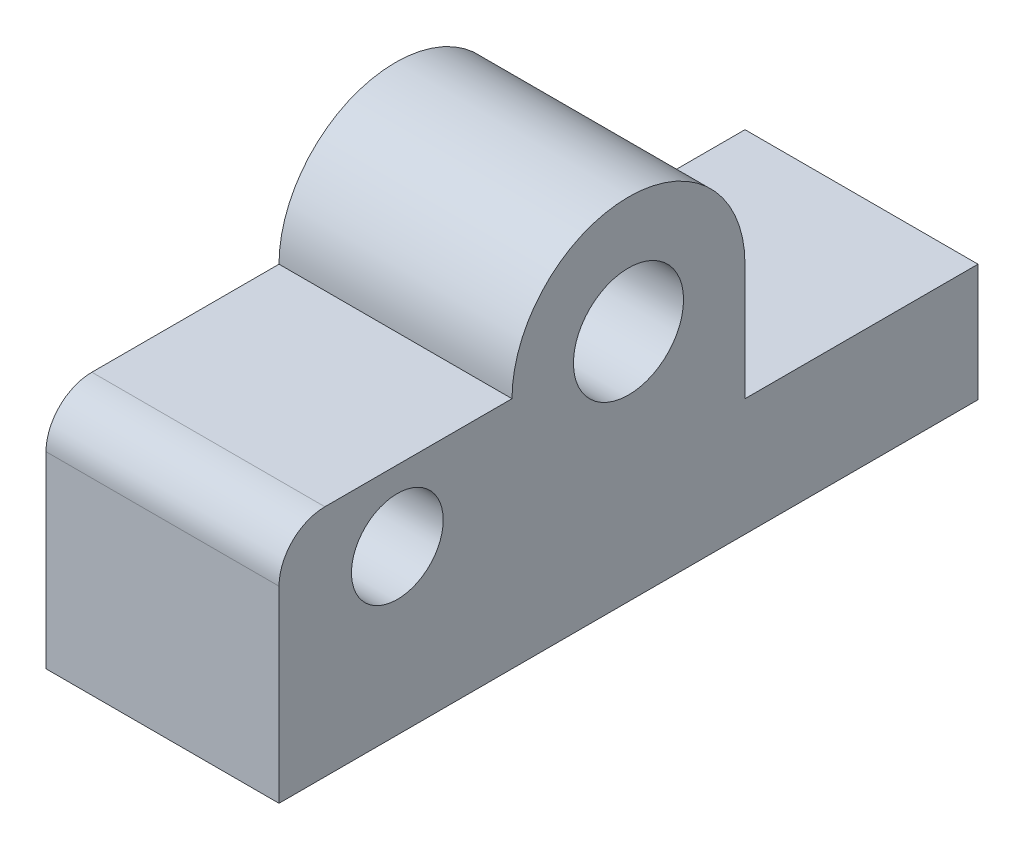
ISO-10303-21;
HEADER;
FILE_DESCRIPTION(('STEP AP214'),'2;1');
FILE_NAME('part.step','',(''),(''),'','','');
FILE_SCHEMA(('AUTOMOTIVE_DESIGN { 1 0 10303 214 1 1 1 1 }'));
ENDSEC;
DATA;
#1=APPLICATION_CONTEXT('core data for automotive mechanical design processes');
#2=APPLICATION_PROTOCOL_DEFINITION('international standard','automotive_design',2000,#1);
#3=PRODUCT_CONTEXT('',#1,'mechanical');
#4=PRODUCT('Part','Part','',(#3));
#5=PRODUCT_RELATED_PRODUCT_CATEGORY('part','',(#4));
#6=PRODUCT_DEFINITION_FORMATION('','',#4);
#7=PRODUCT_DEFINITION_CONTEXT('part definition',#1,'design');
#8=PRODUCT_DEFINITION('design','',#6,#7);
#9=PRODUCT_DEFINITION_SHAPE('','',#8);
#10=(LENGTH_UNIT() NAMED_UNIT(*) SI_UNIT(.MILLI.,.METRE.));
#11=(NAMED_UNIT(*) PLANE_ANGLE_UNIT() SI_UNIT($,.RADIAN.));
#12=(NAMED_UNIT(*) SI_UNIT($,.STERADIAN.) SOLID_ANGLE_UNIT());
#13=UNCERTAINTY_MEASURE_WITH_UNIT(LENGTH_MEASURE(1.E-05),#10,'distance_accuracy_value','');
#14=(GEOMETRIC_REPRESENTATION_CONTEXT(3) GLOBAL_UNCERTAINTY_ASSIGNED_CONTEXT((#13)) GLOBAL_UNIT_ASSIGNED_CONTEXT((#10,
#11,#12)) REPRESENTATION_CONTEXT('',''));
#15=CARTESIAN_POINT('',(0.,0.,0.));
#16=DIRECTION('',(0.,0.,1.));
#17=DIRECTION('',(1.,0.,0.));
#18=AXIS2_PLACEMENT_3D('',#15,#16,#17);
#19=CARTESIAN_POINT('',(25.4,-25.5,38.1));
#20=DIRECTION('',(0.,0.,-1.));
#21=DIRECTION('',(-1.,0.,0.));
#22=AXIS2_PLACEMENT_3D('',#19,#20,#21);
#23=PLANE('',#22);
#24=DIRECTION('',(0.,-1.,0.));
#25=VECTOR('',#24,1.);
#26=CARTESIAN_POINT('',(25.4,0.,38.1));
#27=LINE('',#26,#25);
#28=CARTESIAN_POINT('',(25.4,-5.,38.1));
#29=VERTEX_POINT('',#28);
#30=CARTESIAN_POINT('',(25.4,-25.5,38.1));
#31=VERTEX_POINT('',#30);
#32=EDGE_CURVE('E99',#29,#31,#27,.T.);
#33=ORIENTED_EDGE('',*,*,#32,.F.);
#34=DIRECTION('',(-1.,0.,0.));
#35=VECTOR('',#34,1.);
#36=CARTESIAN_POINT('',(25.4,-5.,38.1));
#37=LINE('',#36,#35);
#38=CARTESIAN_POINT('',(0.,-5.,38.1));
#39=VERTEX_POINT('',#38);
#40=EDGE_CURVE('E116',#29,#39,#37,.T.);
#41=ORIENTED_EDGE('',*,*,#40,.T.);
#42=DIRECTION('',(0.,-1.,0.));
#43=VECTOR('',#42,1.);
#44=CARTESIAN_POINT('',(0.,-25.5,38.1));
#45=LINE('',#44,#43);
#46=CARTESIAN_POINT('',(0.,-25.5,38.1));
#47=VERTEX_POINT('',#46);
#48=EDGE_CURVE('E113',#39,#47,#45,.T.);
#49=ORIENTED_EDGE('',*,*,#48,.T.);
#50=DIRECTION('',(-1.,0.,0.));
#51=VECTOR('',#50,1.);
#52=CARTESIAN_POINT('',(25.4,-25.5,38.1));
#53=LINE('',#52,#51);
#54=EDGE_CURVE('E112',#31,#47,#53,.T.);
#55=ORIENTED_EDGE('',*,*,#54,.F.);
#56=EDGE_LOOP('',(#33,#41,#49,#55));
#57=FACE_BOUND('',#56,.T.);
#58=ADVANCED_FACE('F35',(#57),#23,.F.);
#59=CARTESIAN_POINT('',(25.4,-25.5,-38.1));
#60=DIRECTION('',(0.,1.,0.));
#61=DIRECTION('',(0.,0.,1.));
#62=AXIS2_PLACEMENT_3D('',#59,#60,#61);
#63=PLANE('',#62);
#64=DIRECTION('',(0.,0.,-1.));
#65=VECTOR('',#64,1.);
#66=CARTESIAN_POINT('',(0.,-25.5,-38.1));
#67=LINE('',#66,#65);
#68=CARTESIAN_POINT('',(0.,-25.5,-38.1));
#69=VERTEX_POINT('',#68);
#70=EDGE_CURVE('E137',#47,#69,#67,.T.);
#71=ORIENTED_EDGE('',*,*,#70,.T.);
#72=DIRECTION('',(-1.,0.,0.));
#73=VECTOR('',#72,1.);
#74=CARTESIAN_POINT('',(25.4,-25.5,-38.1));
#75=LINE('',#74,#73);
#76=CARTESIAN_POINT('',(25.4,-25.5,-38.1));
#77=VERTEX_POINT('',#76);
#78=EDGE_CURVE('E117',#77,#69,#75,.T.);
#79=ORIENTED_EDGE('',*,*,#78,.F.);
#80=DIRECTION('',(0.,0.,-1.));
#81=VECTOR('',#80,1.);
#82=CARTESIAN_POINT('',(25.4,-25.5,-38.1));
#83=LINE('',#82,#81);
#84=EDGE_CURVE('E103',#31,#77,#83,.T.);
#85=ORIENTED_EDGE('',*,*,#84,.F.);
#86=ORIENTED_EDGE('',*,*,#54,.T.);
#87=EDGE_LOOP('',(#71,#79,#85,#86));
#88=FACE_BOUND('',#87,.T.);
#89=ADVANCED_FACE('F119',(#88),#63,.F.);
#90=CARTESIAN_POINT('',(25.4,-12.7,-38.1));
#91=DIRECTION('',(0.,0.,1.));
#92=DIRECTION('',(1.,0.,0.));
#93=AXIS2_PLACEMENT_3D('',#90,#91,#92);
#94=PLANE('',#93);
#95=DIRECTION('',(0.,1.,0.));
#96=VECTOR('',#95,1.);
#97=CARTESIAN_POINT('',(0.,-12.7,-38.1));
#98=LINE('',#97,#96);
#99=CARTESIAN_POINT('',(0.,-12.7,-38.1));
#100=VERTEX_POINT('',#99);
#101=EDGE_CURVE('E140',#69,#100,#98,.T.);
#102=ORIENTED_EDGE('',*,*,#101,.T.);
#103=DIRECTION('',(-1.,0.,0.));
#104=VECTOR('',#103,1.);
#105=CARTESIAN_POINT('',(25.4,-12.7,-38.1));
#106=LINE('',#105,#104);
#107=CARTESIAN_POINT('',(25.4,-12.7,-38.1));
#108=VERTEX_POINT('',#107);
#109=EDGE_CURVE('E157',#108,#100,#106,.T.);
#110=ORIENTED_EDGE('',*,*,#109,.F.);
#111=DIRECTION('',(0.,1.,0.));
#112=VECTOR('',#111,1.);
#113=CARTESIAN_POINT('',(25.4,-12.7,-38.1));
#114=LINE('',#113,#112);
#115=EDGE_CURVE('E122',#77,#108,#114,.T.);
#116=ORIENTED_EDGE('',*,*,#115,.F.);
#117=ORIENTED_EDGE('',*,*,#78,.T.);
#118=EDGE_LOOP('',(#102,#110,#116,#117));
#119=FACE_BOUND('',#118,.T.);
#120=ADVANCED_FACE('F167',(#119),#94,.F.);
#121=CARTESIAN_POINT('',(25.4,-12.7,-12.7));
#122=DIRECTION('',(0.,-1.,0.));
#123=DIRECTION('',(0.,0.,-1.));
#124=AXIS2_PLACEMENT_3D('',#121,#122,#123);
#125=PLANE('',#124);
#126=DIRECTION('',(0.,0.,1.));
#127=VECTOR('',#126,1.);
#128=CARTESIAN_POINT('',(0.,-12.7,-12.7));
#129=LINE('',#128,#127);
#130=CARTESIAN_POINT('',(0.,-12.7,-12.7));
#131=VERTEX_POINT('',#130);
#132=EDGE_CURVE('E142',#100,#131,#129,.T.);
#133=ORIENTED_EDGE('',*,*,#132,.T.);
#134=DIRECTION('',(-1.,0.,0.));
#135=VECTOR('',#134,1.);
#136=CARTESIAN_POINT('',(25.4,-12.7,-12.7));
#137=LINE('',#136,#135);
#138=CARTESIAN_POINT('',(25.4,-12.7,-12.7));
#139=VERTEX_POINT('',#138);
#140=EDGE_CURVE('E154',#139,#131,#137,.T.);
#141=ORIENTED_EDGE('',*,*,#140,.F.);
#142=DIRECTION('',(0.,0.,1.));
#143=VECTOR('',#142,1.);
#144=CARTESIAN_POINT('',(25.4,-12.7,-12.7));
#145=LINE('',#144,#143);
#146=EDGE_CURVE('E124',#108,#139,#145,.T.);
#147=ORIENTED_EDGE('',*,*,#146,.F.);
#148=ORIENTED_EDGE('',*,*,#109,.T.);
#149=EDGE_LOOP('',(#133,#141,#147,#148));
#150=FACE_BOUND('',#149,.T.);
#151=ADVANCED_FACE('F174',(#150),#125,.F.);
#152=CARTESIAN_POINT('',(25.4,0.,-12.7));
#153=DIRECTION('',(0.,0.,1.));
#154=DIRECTION('',(0.,-1.,0.));
#155=AXIS2_PLACEMENT_3D('',#152,#153,#154);
#156=PLANE('',#155);
#157=DIRECTION('',(0.,1.,0.));
#158=VECTOR('',#157,1.);
#159=CARTESIAN_POINT('',(0.,0.,-12.7));
#160=LINE('',#159,#158);
#161=CARTESIAN_POINT('',(0.,0.,-12.7));
#162=VERTEX_POINT('',#161);
#163=EDGE_CURVE('E144',#131,#162,#160,.T.);
#164=ORIENTED_EDGE('',*,*,#163,.T.);
#165=DIRECTION('',(-1.,0.,0.));
#166=VECTOR('',#165,1.);
#167=CARTESIAN_POINT('',(25.4,0.,-12.7));
#168=LINE('',#167,#166);
#169=CARTESIAN_POINT('',(25.4,0.,-12.7));
#170=VERTEX_POINT('',#169);
#171=EDGE_CURVE('E151',#170,#162,#168,.T.);
#172=ORIENTED_EDGE('',*,*,#171,.F.);
#173=DIRECTION('',(0.,1.,0.));
#174=VECTOR('',#173,1.);
#175=CARTESIAN_POINT('',(25.4,0.,-12.7));
#176=LINE('',#175,#174);
#177=EDGE_CURVE('E129',#139,#170,#176,.T.);
#178=ORIENTED_EDGE('',*,*,#177,.F.);
#179=ORIENTED_EDGE('',*,*,#140,.T.);
#180=EDGE_LOOP('',(#164,#172,#178,#179));
#181=FACE_BOUND('',#180,.T.);
#182=ADVANCED_FACE('F177',(#181),#156,.F.);
#183=CARTESIAN_POINT('',(25.4,0.,0.));
#184=DIRECTION('',(-1.,0.,0.));
#185=DIRECTION('',(0.,0.,1.));
#186=AXIS2_PLACEMENT_3D('',#183,#184,#185);
#187=CYLINDRICAL_SURFACE('',#186,12.7);
#188=CARTESIAN_POINT('',(0.,0.,0.));
#189=DIRECTION('',(1.,0.,0.));
#190=DIRECTION('',(0.,0.,-1.));
#191=AXIS2_PLACEMENT_3D('',#188,#189,#190);
#192=CIRCLE('',#191,12.7);
#193=CARTESIAN_POINT('',(0.,0.,12.7));
#194=VERTEX_POINT('',#193);
#195=EDGE_CURVE('E146',#162,#194,#192,.T.);
#196=ORIENTED_EDGE('',*,*,#195,.T.);
#197=DIRECTION('',(-1.,0.,0.));
#198=VECTOR('',#197,1.);
#199=CARTESIAN_POINT('',(25.4,0.,12.7));
#200=LINE('',#199,#198);
#201=CARTESIAN_POINT('',(25.4,0.,12.7));
#202=VERTEX_POINT('',#201);
#203=EDGE_CURVE('E135',#202,#194,#200,.T.);
#204=ORIENTED_EDGE('',*,*,#203,.F.);
#205=CARTESIAN_POINT('',(25.4,0.,0.));
#206=DIRECTION('',(1.,0.,0.));
#207=DIRECTION('',(0.,0.,-1.));
#208=AXIS2_PLACEMENT_3D('',#205,#206,#207);
#209=CIRCLE('',#208,12.7);
#210=EDGE_CURVE('E131',#170,#202,#209,.T.);
#211=ORIENTED_EDGE('',*,*,#210,.F.);
#212=ORIENTED_EDGE('',*,*,#171,.T.);
#213=EDGE_LOOP('',(#196,#204,#211,#212));
#214=FACE_BOUND('',#213,.T.);
#215=ADVANCED_FACE('F182',(#214),#187,.T.);
#216=CARTESIAN_POINT('',(25.4,0.,12.7));
#217=DIRECTION('',(0.,-1.,0.));
#218=DIRECTION('',(0.,0.,-1.));
#219=AXIS2_PLACEMENT_3D('',#216,#217,#218);
#220=PLANE('',#219);
#221=DIRECTION('',(0.,0.,1.));
#222=VECTOR('',#221,1.);
#223=CARTESIAN_POINT('',(0.,0.,12.7));
#224=LINE('',#223,#222);
#225=CARTESIAN_POINT('',(0.,0.,33.1));
#226=VERTEX_POINT('',#225);
#227=EDGE_CURVE('E109',#194,#226,#224,.T.);
#228=ORIENTED_EDGE('',*,*,#227,.T.);
#229=DIRECTION('',(-1.,0.,0.));
#230=VECTOR('',#229,1.);
#231=CARTESIAN_POINT('',(25.4,0.,33.1));
#232=LINE('',#231,#230);
#233=CARTESIAN_POINT('',(25.4,0.,33.1));
#234=VERTEX_POINT('',#233);
#235=EDGE_CURVE('E43',#226,#234,#232,.F.);
#236=ORIENTED_EDGE('',*,*,#235,.T.);
#237=DIRECTION('',(0.,0.,1.));
#238=VECTOR('',#237,1.);
#239=CARTESIAN_POINT('',(25.4,0.,12.7));
#240=LINE('',#239,#238);
#241=EDGE_CURVE('E133',#202,#234,#240,.T.);
#242=ORIENTED_EDGE('',*,*,#241,.F.);
#243=ORIENTED_EDGE('',*,*,#203,.T.);
#244=EDGE_LOOP('',(#228,#236,#242,#243));
#245=FACE_BOUND('',#244,.T.);
#246=ADVANCED_FACE('F205',(#245),#220,.F.);
#247=CARTESIAN_POINT('',(25.4,0.,0.));
#248=DIRECTION('',(1.,0.,0.));
#249=DIRECTION('',(0.,0.,-1.));
#250=AXIS2_PLACEMENT_3D('',#247,#248,#249);
#251=PLANE('',#250);
#252=CARTESIAN_POINT('',(25.4,-7.7,25.2));
#253=DIRECTION('',(1.,0.,0.));
#254=DIRECTION('',(0.,0.,-1.));
#255=AXIS2_PLACEMENT_3D('',#252,#253,#254);
#256=CIRCLE('',#255,5.);
#257=CARTESIAN_POINT('',(25.4,-7.7,20.2));
#258=VERTEX_POINT('',#257);
#259=EDGE_CURVE('E228',#258,#258,#256,.T.);
#260=ORIENTED_EDGE('',*,*,#259,.F.);
#261=EDGE_LOOP('',(#260));
#262=FACE_BOUND('',#261,.T.);
#263=CARTESIAN_POINT('',(25.4,0.,0.));
#264=DIRECTION('',(1.,0.,0.));
#265=DIRECTION('',(0.,0.,-1.));
#266=AXIS2_PLACEMENT_3D('',#263,#264,#265);
#267=CIRCLE('',#266,6.);
#268=CARTESIAN_POINT('',(25.4,0.,-6.));
#269=VERTEX_POINT('',#268);
#270=EDGE_CURVE('E223',#269,#269,#267,.T.);
#271=ORIENTED_EDGE('',*,*,#270,.F.);
#272=EDGE_LOOP('',(#271));
#273=FACE_BOUND('',#272,.T.);
#274=ORIENTED_EDGE('',*,*,#241,.T.);
#275=CARTESIAN_POINT('',(25.4,-5.,33.1));
#276=DIRECTION('',(1.,0.,0.));
#277=DIRECTION('',(0.,0.,-1.));
#278=AXIS2_PLACEMENT_3D('',#275,#276,#277);
#279=CIRCLE('',#278,5.);
#280=EDGE_CURVE('E11',#234,#29,#279,.T.);
#281=ORIENTED_EDGE('',*,*,#280,.T.);
#282=ORIENTED_EDGE('',*,*,#32,.T.);
#283=ORIENTED_EDGE('',*,*,#84,.T.);
#284=ORIENTED_EDGE('',*,*,#115,.T.);
#285=ORIENTED_EDGE('',*,*,#146,.T.);
#286=ORIENTED_EDGE('',*,*,#177,.T.);
#287=ORIENTED_EDGE('',*,*,#210,.T.);
#288=EDGE_LOOP('',(#274,#281,#282,#283,#284,#285,#286,#287));
#289=FACE_BOUND('',#288,.T.);
#290=ADVANCED_FACE('F101',(#262,#273,#289),#251,.T.);
#291=CARTESIAN_POINT('',(0.,0.,0.));
#292=DIRECTION('',(1.,0.,0.));
#293=DIRECTION('',(0.,0.,-1.));
#294=AXIS2_PLACEMENT_3D('',#291,#292,#293);
#295=PLANE('',#294);
#296=CARTESIAN_POINT('',(0.,-7.7,25.2));
#297=DIRECTION('',(1.,0.,0.));
#298=DIRECTION('',(0.,0.,-1.));
#299=AXIS2_PLACEMENT_3D('',#296,#297,#298);
#300=CIRCLE('',#299,5.);
#301=CARTESIAN_POINT('',(0.,-7.7,20.2));
#302=VERTEX_POINT('',#301);
#303=EDGE_CURVE('E225',#302,#302,#300,.T.);
#304=ORIENTED_EDGE('',*,*,#303,.T.);
#305=EDGE_LOOP('',(#304));
#306=FACE_BOUND('',#305,.T.);
#307=CARTESIAN_POINT('',(0.,0.,0.));
#308=DIRECTION('',(1.,0.,0.));
#309=DIRECTION('',(0.,0.,-1.));
#310=AXIS2_PLACEMENT_3D('',#307,#308,#309);
#311=CIRCLE('',#310,6.);
#312=CARTESIAN_POINT('',(0.,0.,-6.));
#313=VERTEX_POINT('',#312);
#314=EDGE_CURVE('E138',#313,#313,#311,.T.);
#315=ORIENTED_EDGE('',*,*,#314,.T.);
#316=EDGE_LOOP('',(#315));
#317=FACE_BOUND('',#316,.T.);
#318=ORIENTED_EDGE('',*,*,#48,.F.);
#319=CARTESIAN_POINT('',(0.,-5.,33.1));
#320=DIRECTION('',(1.,0.,0.));
#321=DIRECTION('',(0.,0.,-1.));
#322=AXIS2_PLACEMENT_3D('',#319,#320,#321);
#323=CIRCLE('',#322,5.);
#324=EDGE_CURVE('E57',#39,#226,#323,.F.);
#325=ORIENTED_EDGE('',*,*,#324,.T.);
#326=ORIENTED_EDGE('',*,*,#227,.F.);
#327=ORIENTED_EDGE('',*,*,#195,.F.);
#328=ORIENTED_EDGE('',*,*,#163,.F.);
#329=ORIENTED_EDGE('',*,*,#132,.F.);
#330=ORIENTED_EDGE('',*,*,#101,.F.);
#331=ORIENTED_EDGE('',*,*,#70,.F.);
#332=EDGE_LOOP('',(#318,#325,#326,#327,#328,#329,#330,#331));
#333=FACE_BOUND('',#332,.T.);
#334=ADVANCED_FACE('F163',(#306,#317,#333),#295,.F.);
#335=CARTESIAN_POINT('',(0.,0.,0.));
#336=DIRECTION('',(1.,0.,0.));
#337=DIRECTION('',(0.,0.,-1.));
#338=AXIS2_PLACEMENT_3D('',#335,#336,#337);
#339=CYLINDRICAL_SURFACE('',#338,6.);
#340=ORIENTED_EDGE('',*,*,#314,.F.);
#341=EDGE_LOOP('',(#340));
#342=FACE_BOUND('',#341,.T.);
#343=ORIENTED_EDGE('',*,*,#270,.T.);
#344=EDGE_LOOP('',(#343));
#345=FACE_BOUND('',#344,.T.);
#346=ADVANCED_FACE('F188',(#342,#345),#339,.F.);
#347=CARTESIAN_POINT('',(0.,-7.7,25.2));
#348=DIRECTION('',(1.,0.,0.));
#349=DIRECTION('',(0.,0.,-1.));
#350=AXIS2_PLACEMENT_3D('',#347,#348,#349);
#351=CYLINDRICAL_SURFACE('',#350,5.);
#352=ORIENTED_EDGE('',*,*,#303,.F.);
#353=EDGE_LOOP('',(#352));
#354=FACE_BOUND('',#353,.T.);
#355=ORIENTED_EDGE('',*,*,#259,.T.);
#356=EDGE_LOOP('',(#355));
#357=FACE_BOUND('',#356,.T.);
#358=ADVANCED_FACE('F184',(#354,#357),#351,.F.);
#359=CARTESIAN_POINT('',(25.4,-5.,33.1));
#360=DIRECTION('',(-1.,0.,0.));
#361=DIRECTION('',(0.,0.,1.));
#362=AXIS2_PLACEMENT_3D('',#359,#360,#361);
#363=CYLINDRICAL_SURFACE('',#362,5.);
#364=ORIENTED_EDGE('',*,*,#280,.F.);
#365=ORIENTED_EDGE('',*,*,#235,.F.);
#366=ORIENTED_EDGE('',*,*,#324,.F.);
#367=ORIENTED_EDGE('',*,*,#40,.F.);
#368=EDGE_LOOP('',(#364,#365,#366,#367));
#369=FACE_BOUND('',#368,.T.);
#370=ADVANCED_FACE('F37',(#369),#363,.T.);
#371=CLOSED_SHELL('',(#58,#89,#120,#151,#182,#215,#246,#290,#334,#346,#358,#370));
#372=MANIFOLD_SOLID_BREP('B2',#371);
#373=ADVANCED_BREP_SHAPE_REPRESENTATION('',(#18,#372),#14);
#374=SHAPE_DEFINITION_REPRESENTATION(#9,#373);
ENDSEC;
END-ISO-10303-21;
